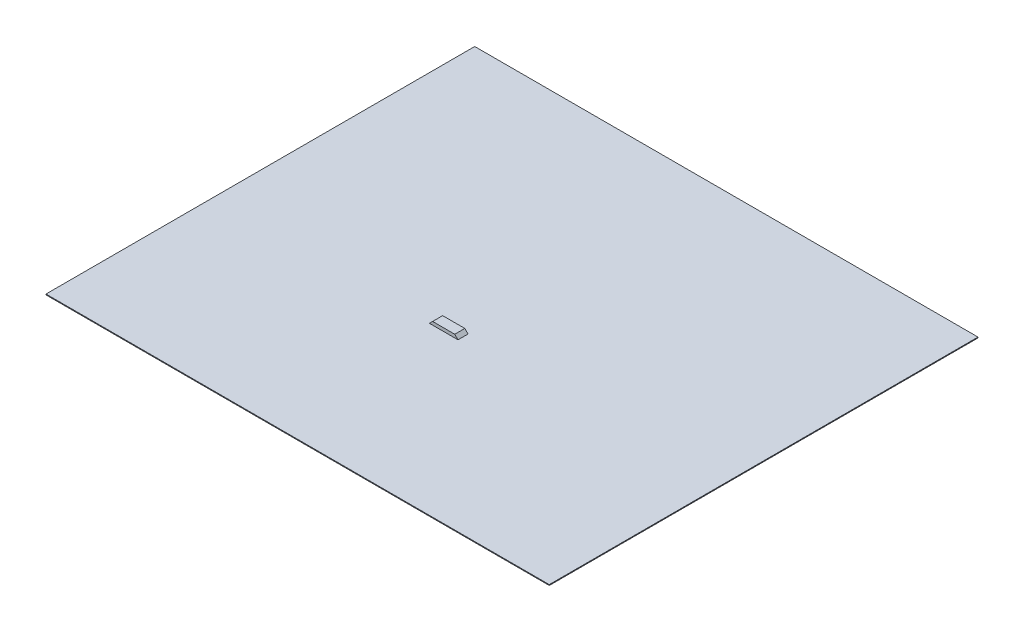
ISO-10303-21;
HEADER;
FILE_DESCRIPTION(('STEP AP214'),'2;1');
FILE_NAME('part.step','',(''),(''),'','','');
FILE_SCHEMA(('AUTOMOTIVE_DESIGN { 1 0 10303 214 1 1 1 1 }'));
ENDSEC;
DATA;
#1=APPLICATION_CONTEXT('core data for automotive mechanical design processes');
#2=APPLICATION_PROTOCOL_DEFINITION('international standard','automotive_design',2000,#1);
#3=PRODUCT_CONTEXT('',#1,'mechanical');
#4=PRODUCT('Part','Part','',(#3));
#5=PRODUCT_RELATED_PRODUCT_CATEGORY('part','',(#4));
#6=PRODUCT_DEFINITION_FORMATION('','',#4);
#7=PRODUCT_DEFINITION_CONTEXT('part definition',#1,'design');
#8=PRODUCT_DEFINITION('design','',#6,#7);
#9=PRODUCT_DEFINITION_SHAPE('','',#8);
#10=(LENGTH_UNIT() NAMED_UNIT(*) SI_UNIT(.MILLI.,.METRE.));
#11=(NAMED_UNIT(*) PLANE_ANGLE_UNIT() SI_UNIT($,.RADIAN.));
#12=(NAMED_UNIT(*) SI_UNIT($,.STERADIAN.) SOLID_ANGLE_UNIT());
#13=UNCERTAINTY_MEASURE_WITH_UNIT(LENGTH_MEASURE(1.E-05),#10,'distance_accuracy_value','');
#14=(GEOMETRIC_REPRESENTATION_CONTEXT(3) GLOBAL_UNCERTAINTY_ASSIGNED_CONTEXT((#13)) GLOBAL_UNIT_ASSIGNED_CONTEXT((#10,
#11,#12)) REPRESENTATION_CONTEXT('',''));
#15=CARTESIAN_POINT('',(0.,0.,0.));
#16=DIRECTION('',(0.,0.,1.));
#17=DIRECTION('',(1.,0.,0.));
#18=AXIS2_PLACEMENT_3D('',#15,#16,#17);
#19=CARTESIAN_POINT('',(0.,10.,0.));
#20=DIRECTION('',(0.,1.,0.));
#21=DIRECTION('',(0.,0.,1.));
#22=AXIS2_PLACEMENT_3D('',#19,#20,#21);
#23=PLANE('',#22);
#24=DIRECTION('',(0.,0.,1.));
#25=VECTOR('',#24,1.);
#26=CARTESIAN_POINT('',(-2689.69082162495,10.,-3127.04035568678));
#27=LINE('',#26,#25);
#28=CARTESIAN_POINT('',(-2689.69082162495,10.,-3127.04035568678));
#29=VERTEX_POINT('',#28);
#30=CARTESIAN_POINT('',(-2689.69082162495,10.,2185.39146151423));
#31=VERTEX_POINT('',#30);
#32=EDGE_CURVE('E134',#29,#31,#27,.T.);
#33=ORIENTED_EDGE('',*,*,#32,.T.);
#34=DIRECTION('',(1.,0.,0.));
#35=VECTOR('',#34,1.);
#36=CARTESIAN_POINT('',(-2689.69082162495,10.,2185.39146151423));
#37=LINE('',#36,#35);
#38=CARTESIAN_POINT('',(3546.73796894963,10.,2185.39146151423));
#39=VERTEX_POINT('',#38);
#40=EDGE_CURVE('E137',#31,#39,#37,.T.);
#41=ORIENTED_EDGE('',*,*,#40,.T.);
#42=DIRECTION('',(0.,0.,-1.));
#43=VECTOR('',#42,1.);
#44=CARTESIAN_POINT('',(3546.73796894963,10.,-3127.04035568678));
#45=LINE('',#44,#43);
#46=CARTESIAN_POINT('',(3546.73796894963,10.,-3127.04035568678));
#47=VERTEX_POINT('',#46);
#48=EDGE_CURVE('E140',#39,#47,#45,.T.);
#49=ORIENTED_EDGE('',*,*,#48,.T.);
#50=DIRECTION('',(-1.,0.,0.));
#51=VECTOR('',#50,1.);
#52=CARTESIAN_POINT('',(-2689.69082162495,10.,-3127.04035568678));
#53=LINE('',#52,#51);
#54=EDGE_CURVE('E142',#47,#29,#53,.T.);
#55=ORIENTED_EDGE('',*,*,#54,.T.);
#56=EDGE_LOOP('',(#33,#41,#49,#55));
#57=FACE_BOUND('',#56,.T.);
#58=DIRECTION('',(-1.,0.,0.));
#59=VECTOR('',#58,1.);
#60=CARTESIAN_POINT('',(354.470716076167,10.,0.));
#61=LINE('',#60,#59);
#62=CARTESIAN_POINT('',(354.470716076167,10.,0.));
#63=VERTEX_POINT('',#62);
#64=CARTESIAN_POINT('',(0.,10.,0.));
#65=VERTEX_POINT('',#64);
#66=EDGE_CURVE('E108',#63,#65,#61,.T.);
#67=ORIENTED_EDGE('',*,*,#66,.F.);
#68=DIRECTION('',(0.,0.,-1.));
#69=VECTOR('',#68,1.);
#70=CARTESIAN_POINT('',(354.470716076167,10.,0.));
#71=LINE('',#70,#69);
#72=CARTESIAN_POINT('',(354.470716076167,10.,124.389132605426));
#73=VERTEX_POINT('',#72);
#74=EDGE_CURVE('E121',#73,#63,#71,.T.);
#75=ORIENTED_EDGE('',*,*,#74,.F.);
#76=DIRECTION('',(1.,0.,0.));
#77=VECTOR('',#76,1.);
#78=CARTESIAN_POINT('',(354.470716076167,10.,124.389132605426));
#79=LINE('',#78,#77);
#80=CARTESIAN_POINT('',(0.,10.,124.389132605426));
#81=VERTEX_POINT('',#80);
#82=EDGE_CURVE('E132',#81,#73,#79,.T.);
#83=ORIENTED_EDGE('',*,*,#82,.F.);
#84=DIRECTION('',(0.,0.,1.));
#85=VECTOR('',#84,1.);
#86=CARTESIAN_POINT('',(0.,10.,0.));
#87=LINE('',#86,#85);
#88=EDGE_CURVE('E122',#65,#81,#87,.T.);
#89=ORIENTED_EDGE('',*,*,#88,.F.);
#90=EDGE_LOOP('',(#67,#75,#83,#89));
#91=FACE_BOUND('',#90,.T.);
#92=ADVANCED_FACE('F41',(#57,#91),#23,.T.);
#93=CARTESIAN_POINT('',(-2689.69082162495,10.,-3127.04035568678));
#94=DIRECTION('',(1.,0.,0.));
#95=DIRECTION('',(0.,0.,-1.));
#96=AXIS2_PLACEMENT_3D('',#93,#94,#95);
#97=PLANE('',#96);
#98=DIRECTION('',(0.,0.,1.));
#99=VECTOR('',#98,1.);
#100=CARTESIAN_POINT('',(-2689.69082162495,0.,-3127.04035568678));
#101=LINE('',#100,#99);
#102=CARTESIAN_POINT('',(-2689.69082162495,0.,-3127.04035568678));
#103=VERTEX_POINT('',#102);
#104=CARTESIAN_POINT('',(-2689.69082162495,0.,2185.39146151423));
#105=VERTEX_POINT('',#104);
#106=EDGE_CURVE('E145',#103,#105,#101,.T.);
#107=ORIENTED_EDGE('',*,*,#106,.T.);
#108=DIRECTION('',(0.,-1.,0.));
#109=VECTOR('',#108,1.);
#110=CARTESIAN_POINT('',(-2689.69082162495,10.,2185.39146151423));
#111=LINE('',#110,#109);
#112=EDGE_CURVE('E161',#31,#105,#111,.T.);
#113=ORIENTED_EDGE('',*,*,#112,.F.);
#114=ORIENTED_EDGE('',*,*,#32,.F.);
#115=DIRECTION('',(0.,-1.,0.));
#116=VECTOR('',#115,1.);
#117=CARTESIAN_POINT('',(-2689.69082162495,10.,-3127.04035568678));
#118=LINE('',#117,#116);
#119=EDGE_CURVE('E144',#29,#103,#118,.T.);
#120=ORIENTED_EDGE('',*,*,#119,.T.);
#121=EDGE_LOOP('',(#107,#113,#114,#120));
#122=FACE_BOUND('',#121,.T.);
#123=ADVANCED_FACE('F179',(#122),#97,.F.);
#124=CARTESIAN_POINT('',(-2689.69082162495,10.,2185.39146151423));
#125=DIRECTION('',(0.,0.,-1.));
#126=DIRECTION('',(-1.,0.,0.));
#127=AXIS2_PLACEMENT_3D('',#124,#125,#126);
#128=PLANE('',#127);
#129=DIRECTION('',(1.,0.,0.));
#130=VECTOR('',#129,1.);
#131=CARTESIAN_POINT('',(-2689.69082162495,0.,2185.39146151423));
#132=LINE('',#131,#130);
#133=CARTESIAN_POINT('',(3546.73796894963,0.,2185.39146151423));
#134=VERTEX_POINT('',#133);
#135=EDGE_CURVE('E148',#105,#134,#132,.T.);
#136=ORIENTED_EDGE('',*,*,#135,.T.);
#137=DIRECTION('',(0.,-1.,0.));
#138=VECTOR('',#137,1.);
#139=CARTESIAN_POINT('',(3546.73796894963,10.,2185.39146151423));
#140=LINE('',#139,#138);
#141=EDGE_CURVE('E158',#39,#134,#140,.T.);
#142=ORIENTED_EDGE('',*,*,#141,.F.);
#143=ORIENTED_EDGE('',*,*,#40,.F.);
#144=ORIENTED_EDGE('',*,*,#112,.T.);
#145=EDGE_LOOP('',(#136,#142,#143,#144));
#146=FACE_BOUND('',#145,.T.);
#147=ADVANCED_FACE('F187',(#146),#128,.F.);
#148=CARTESIAN_POINT('',(3546.73796894963,10.,-3127.04035568678));
#149=DIRECTION('',(-1.,0.,0.));
#150=DIRECTION('',(0.,0.,1.));
#151=AXIS2_PLACEMENT_3D('',#148,#149,#150);
#152=PLANE('',#151);
#153=DIRECTION('',(0.,0.,-1.));
#154=VECTOR('',#153,1.);
#155=CARTESIAN_POINT('',(3546.73796894963,0.,-3127.04035568678));
#156=LINE('',#155,#154);
#157=CARTESIAN_POINT('',(3546.73796894963,0.,-3127.04035568678));
#158=VERTEX_POINT('',#157);
#159=EDGE_CURVE('E150',#134,#158,#156,.T.);
#160=ORIENTED_EDGE('',*,*,#159,.T.);
#161=DIRECTION('',(0.,-1.,0.));
#162=VECTOR('',#161,1.);
#163=CARTESIAN_POINT('',(3546.73796894963,10.,-3127.04035568678));
#164=LINE('',#163,#162);
#165=EDGE_CURVE('E155',#47,#158,#164,.T.);
#166=ORIENTED_EDGE('',*,*,#165,.F.);
#167=ORIENTED_EDGE('',*,*,#48,.F.);
#168=ORIENTED_EDGE('',*,*,#141,.T.);
#169=EDGE_LOOP('',(#160,#166,#167,#168));
#170=FACE_BOUND('',#169,.T.);
#171=ADVANCED_FACE('F199',(#170),#152,.F.);
#172=CARTESIAN_POINT('',(-2689.69082162495,10.,-3127.04035568678));
#173=DIRECTION('',(0.,0.,1.));
#174=DIRECTION('',(1.,0.,0.));
#175=AXIS2_PLACEMENT_3D('',#172,#173,#174);
#176=PLANE('',#175);
#177=DIRECTION('',(-1.,0.,0.));
#178=VECTOR('',#177,1.);
#179=CARTESIAN_POINT('',(-2689.69082162495,0.,-3127.04035568678));
#180=LINE('',#179,#178);
#181=EDGE_CURVE('E138',#158,#103,#180,.T.);
#182=ORIENTED_EDGE('',*,*,#181,.T.);
#183=ORIENTED_EDGE('',*,*,#119,.F.);
#184=ORIENTED_EDGE('',*,*,#54,.F.);
#185=ORIENTED_EDGE('',*,*,#165,.T.);
#186=EDGE_LOOP('',(#182,#183,#184,#185));
#187=FACE_BOUND('',#186,.T.);
#188=ADVANCED_FACE('F195',(#187),#176,.F.);
#189=CARTESIAN_POINT('',(0.,0.,0.));
#190=DIRECTION('',(0.,1.,0.));
#191=DIRECTION('',(0.,0.,1.));
#192=AXIS2_PLACEMENT_3D('',#189,#190,#191);
#193=PLANE('',#192);
#194=ORIENTED_EDGE('',*,*,#106,.F.);
#195=ORIENTED_EDGE('',*,*,#181,.F.);
#196=ORIENTED_EDGE('',*,*,#159,.F.);
#197=ORIENTED_EDGE('',*,*,#135,.F.);
#198=EDGE_LOOP('',(#194,#195,#196,#197));
#199=FACE_BOUND('',#198,.T.);
#200=ADVANCED_FACE('F192',(#199),#193,.F.);
#201=CARTESIAN_POINT('',(354.470716076167,50.,0.));
#202=DIRECTION('',(0.,0.,1.));
#203=DIRECTION('',(1.,0.,0.));
#204=AXIS2_PLACEMENT_3D('',#201,#202,#203);
#205=PLANE('',#204);
#206=DIRECTION('',(-1.,0.,0.));
#207=VECTOR('',#206,1.);
#208=CARTESIAN_POINT('',(354.470716076167,50.,0.));
#209=LINE('',#208,#207);
#210=CARTESIAN_POINT('',(314.470716076167,50.,0.));
#211=VERTEX_POINT('',#210);
#212=CARTESIAN_POINT('',(40.,50.,0.));
#213=VERTEX_POINT('',#212);
#214=EDGE_CURVE('E111',#211,#213,#209,.T.);
#215=ORIENTED_EDGE('',*,*,#214,.F.);
#216=DIRECTION('',(-0.707106781186548,0.707106781186548,0.));
#217=VECTOR('',#216,1.);
#218=CARTESIAN_POINT('',(314.470716076167,50.,0.));
#219=LINE('',#218,#217);
#220=EDGE_CURVE('E105',#211,#63,#219,.F.);
#221=ORIENTED_EDGE('',*,*,#220,.T.);
#222=ORIENTED_EDGE('',*,*,#66,.T.);
#223=DIRECTION('',(-0.707106781186548,-0.707106781186548,0.));
#224=VECTOR('',#223,1.);
#225=CARTESIAN_POINT('',(40.,50.,0.));
#226=LINE('',#225,#224);
#227=EDGE_CURVE('E116',#65,#213,#226,.F.);
#228=ORIENTED_EDGE('',*,*,#227,.T.);
#229=EDGE_LOOP('',(#215,#221,#222,#228));
#230=FACE_BOUND('',#229,.T.);
#231=ADVANCED_FACE('F107',(#230),#205,.F.);
#232=CARTESIAN_POINT('',(354.470716076167,50.,124.389132605426));
#233=DIRECTION('',(0.,0.,-1.));
#234=DIRECTION('',(-1.,0.,0.));
#235=AXIS2_PLACEMENT_3D('',#232,#233,#234);
#236=PLANE('',#235);
#237=ORIENTED_EDGE('',*,*,#82,.T.);
#238=DIRECTION('',(0.707106781186548,-0.707106781186548,0.));
#239=VECTOR('',#238,1.);
#240=CARTESIAN_POINT('',(314.470716076167,50.,124.389132605426));
#241=LINE('',#240,#239);
#242=CARTESIAN_POINT('',(314.470716076167,50.,124.389132605426));
#243=VERTEX_POINT('',#242);
#244=EDGE_CURVE('E11',#73,#243,#241,.F.);
#245=ORIENTED_EDGE('',*,*,#244,.T.);
#246=DIRECTION('',(1.,0.,0.));
#247=VECTOR('',#246,1.);
#248=CARTESIAN_POINT('',(354.470716076167,50.,124.389132605426));
#249=LINE('',#248,#247);
#250=CARTESIAN_POINT('',(40.,50.,124.389132605426));
#251=VERTEX_POINT('',#250);
#252=EDGE_CURVE('E128',#251,#243,#249,.T.);
#253=ORIENTED_EDGE('',*,*,#252,.F.);
#254=DIRECTION('',(0.707106781186548,0.707106781186548,0.));
#255=VECTOR('',#254,1.);
#256=CARTESIAN_POINT('',(40.,50.,124.389132605426));
#257=LINE('',#256,#255);
#258=EDGE_CURVE('E50',#251,#81,#257,.F.);
#259=ORIENTED_EDGE('',*,*,#258,.T.);
#260=EDGE_LOOP('',(#237,#245,#253,#259));
#261=FACE_BOUND('',#260,.T.);
#262=ADVANCED_FACE('F168',(#261),#236,.F.);
#263=CARTESIAN_POINT('',(0.,50.,0.));
#264=DIRECTION('',(0.,-1.,0.));
#265=DIRECTION('',(0.,0.,-1.));
#266=AXIS2_PLACEMENT_3D('',#263,#264,#265);
#267=PLANE('',#266);
#268=ORIENTED_EDGE('',*,*,#252,.T.);
#269=DIRECTION('',(0.,0.,-1.));
#270=VECTOR('',#269,1.);
#271=CARTESIAN_POINT('',(314.470716076167,50.,0.));
#272=LINE('',#271,#270);
#273=EDGE_CURVE('E166',#243,#211,#272,.T.);
#274=ORIENTED_EDGE('',*,*,#273,.T.);
#275=ORIENTED_EDGE('',*,*,#214,.T.);
#276=DIRECTION('',(0.,0.,1.));
#277=VECTOR('',#276,1.);
#278=CARTESIAN_POINT('',(40.,50.,0.));
#279=LINE('',#278,#277);
#280=EDGE_CURVE('E164',#213,#251,#279,.T.);
#281=ORIENTED_EDGE('',*,*,#280,.T.);
#282=EDGE_LOOP('',(#268,#274,#275,#281));
#283=FACE_BOUND('',#282,.T.);
#284=ADVANCED_FACE('F170',(#283),#267,.F.);
#285=CARTESIAN_POINT('',(314.470716076167,50.,0.));
#286=DIRECTION('',(-0.707106781186547,-0.707106781186547,0.));
#287=DIRECTION('',(0.,0.,-1.));
#288=AXIS2_PLACEMENT_3D('',#285,#286,#287);
#289=PLANE('',#288);
#290=ORIENTED_EDGE('',*,*,#244,.F.);
#291=ORIENTED_EDGE('',*,*,#74,.T.);
#292=ORIENTED_EDGE('',*,*,#220,.F.);
#293=ORIENTED_EDGE('',*,*,#273,.F.);
#294=EDGE_LOOP('',(#290,#291,#292,#293));
#295=FACE_BOUND('',#294,.T.);
#296=ADVANCED_FACE('F125',(#295),#289,.F.);
#297=CARTESIAN_POINT('',(40.,50.,0.));
#298=DIRECTION('',(0.707106781186547,-0.707106781186547,0.));
#299=DIRECTION('',(0.,0.,1.));
#300=AXIS2_PLACEMENT_3D('',#297,#298,#299);
#301=PLANE('',#300);
#302=ORIENTED_EDGE('',*,*,#227,.F.);
#303=ORIENTED_EDGE('',*,*,#88,.T.);
#304=ORIENTED_EDGE('',*,*,#258,.F.);
#305=ORIENTED_EDGE('',*,*,#280,.F.);
#306=EDGE_LOOP('',(#302,#303,#304,#305));
#307=FACE_BOUND('',#306,.T.);
#308=ADVANCED_FACE('F44',(#307),#301,.F.);
#309=CLOSED_SHELL('',(#92,#123,#147,#171,#188,#200,#231,#262,#284,#296,#308));
#310=MANIFOLD_SOLID_BREP('B2',#309);
#311=ADVANCED_BREP_SHAPE_REPRESENTATION('',(#18,#310),#14);
#312=SHAPE_DEFINITION_REPRESENTATION(#9,#311);
ENDSEC;
END-ISO-10303-21;
